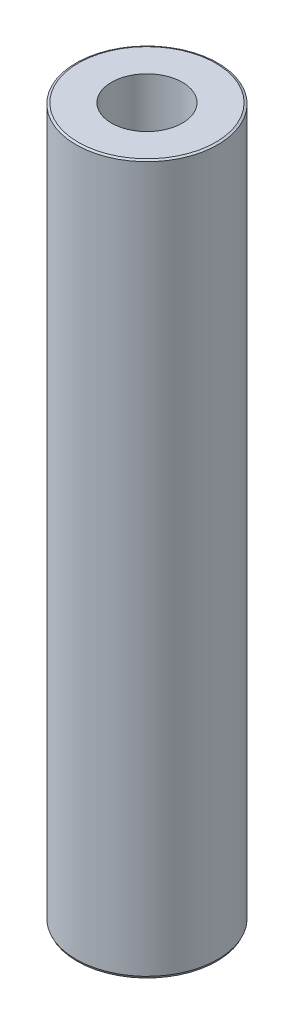
ISO-10303-21;
HEADER;
FILE_DESCRIPTION(('STEP AP214'),'2;1');
FILE_NAME('part.step','',(''),(''),'','','');
FILE_SCHEMA(('AUTOMOTIVE_DESIGN { 1 0 10303 214 1 1 1 1 }'));
ENDSEC;
DATA;
#1=APPLICATION_CONTEXT('core data for automotive mechanical design processes');
#2=APPLICATION_PROTOCOL_DEFINITION('international standard','automotive_design',2000,#1);
#3=PRODUCT_CONTEXT('',#1,'mechanical');
#4=PRODUCT('Part','Part','',(#3));
#5=PRODUCT_RELATED_PRODUCT_CATEGORY('part','',(#4));
#6=PRODUCT_DEFINITION_FORMATION('','',#4);
#7=PRODUCT_DEFINITION_CONTEXT('part definition',#1,'design');
#8=PRODUCT_DEFINITION('design','',#6,#7);
#9=PRODUCT_DEFINITION_SHAPE('','',#8);
#10=(LENGTH_UNIT() NAMED_UNIT(*) SI_UNIT(.MILLI.,.METRE.));
#11=(NAMED_UNIT(*) PLANE_ANGLE_UNIT() SI_UNIT($,.RADIAN.));
#12=(NAMED_UNIT(*) SI_UNIT($,.STERADIAN.) SOLID_ANGLE_UNIT());
#13=UNCERTAINTY_MEASURE_WITH_UNIT(LENGTH_MEASURE(1.E-05),#10,'distance_accuracy_value','');
#14=(GEOMETRIC_REPRESENTATION_CONTEXT(3) GLOBAL_UNCERTAINTY_ASSIGNED_CONTEXT((#13)) GLOBAL_UNIT_ASSIGNED_CONTEXT((#10,
#11,#12)) REPRESENTATION_CONTEXT('',''));
#15=CARTESIAN_POINT('',(0.,0.,0.));
#16=DIRECTION('',(0.,0.,1.));
#17=DIRECTION('',(1.,0.,0.));
#18=AXIS2_PLACEMENT_3D('',#15,#16,#17);
#19=CARTESIAN_POINT('',(0.,600.,0.));
#20=DIRECTION('',(0.,-1.,0.));
#21=DIRECTION('',(0.,0.,-1.));
#22=AXIS2_PLACEMENT_3D('',#19,#20,#21);
#23=CYLINDRICAL_SURFACE('',#22,60.);
#24=CARTESIAN_POINT('',(0.,599.149189009084,0.));
#25=DIRECTION('',(0.,1.,0.));
#26=DIRECTION('',(0.,0.,1.));
#27=AXIS2_PLACEMENT_3D('',#24,#25,#26);
#28=CIRCLE('',#27,60.);
#29=CARTESIAN_POINT('',(0.,599.149189009084,60.));
#30=VERTEX_POINT('',#29);
#31=EDGE_CURVE('E50',#30,#30,#28,.F.);
#32=ORIENTED_EDGE('',*,*,#31,.T.);
#33=EDGE_LOOP('',(#32));
#34=FACE_BOUND('',#33,.T.);
#35=CARTESIAN_POINT('',(0.,1.83664152043228,0.));
#36=DIRECTION('',(0.,1.,0.));
#37=DIRECTION('',(0.,0.,1.));
#38=AXIS2_PLACEMENT_3D('',#35,#36,#37);
#39=CIRCLE('',#38,60.);
#40=CARTESIAN_POINT('',(0.,1.83664152043228,60.));
#41=VERTEX_POINT('',#40);
#42=EDGE_CURVE('E51',#41,#41,#39,.T.);
#43=ORIENTED_EDGE('',*,*,#42,.T.);
#44=EDGE_LOOP('',(#43));
#45=FACE_BOUND('',#44,.T.);
#46=ADVANCED_FACE('F39',(#34,#45),#23,.T.);
#47=CARTESIAN_POINT('',(0.,600.,0.));
#48=DIRECTION('',(0.,1.,0.));
#49=DIRECTION('',(0.,0.,1.));
#50=AXIS2_PLACEMENT_3D('',#47,#48,#49);
#51=PLANE('',#50);
#52=CARTESIAN_POINT('',(0.,600.,0.));
#53=DIRECTION('',(0.,1.,0.));
#54=DIRECTION('',(0.,0.,1.));
#55=AXIS2_PLACEMENT_3D('',#52,#53,#54);
#56=CIRCLE('',#55,58.1633584795674);
#57=CARTESIAN_POINT('',(0.,600.,58.1633584795674));
#58=VERTEX_POINT('',#57);
#59=EDGE_CURVE('E54',#58,#58,#56,.T.);
#60=ORIENTED_EDGE('',*,*,#59,.T.);
#61=EDGE_LOOP('',(#60));
#62=FACE_BOUND('',#61,.T.);
#63=CARTESIAN_POINT('',(0.,600.,0.));
#64=DIRECTION('',(0.,1.,0.));
#65=DIRECTION('',(0.,0.,1.));
#66=AXIS2_PLACEMENT_3D('',#63,#64,#65);
#67=CIRCLE('',#66,29.9901134246437);
#68=CARTESIAN_POINT('',(0.,600.,29.9901134246437));
#69=VERTEX_POINT('',#68);
#70=EDGE_CURVE('E58',#69,#69,#67,.T.);
#71=ORIENTED_EDGE('',*,*,#70,.F.);
#72=EDGE_LOOP('',(#71));
#73=FACE_BOUND('',#72,.T.);
#74=ADVANCED_FACE('F69',(#62,#73),#51,.T.);
#75=CARTESIAN_POINT('',(0.,0.,0.));
#76=DIRECTION('',(0.,1.,0.));
#77=DIRECTION('',(0.,0.,1.));
#78=AXIS2_PLACEMENT_3D('',#75,#76,#77);
#79=PLANE('',#78);
#80=CARTESIAN_POINT('',(0.,0.,0.));
#81=DIRECTION('',(0.,1.,0.));
#82=DIRECTION('',(0.,0.,1.));
#83=AXIS2_PLACEMENT_3D('',#80,#81,#82);
#84=CIRCLE('',#83,59.149189009084);
#85=CARTESIAN_POINT('',(0.,0.,59.149189009084));
#86=VERTEX_POINT('',#85);
#87=EDGE_CURVE('E10',#86,#86,#84,.F.);
#88=ORIENTED_EDGE('',*,*,#87,.T.);
#89=EDGE_LOOP('',(#88));
#90=FACE_BOUND('',#89,.T.);
#91=CARTESIAN_POINT('',(0.,0.,0.));
#92=DIRECTION('',(0.,1.,0.));
#93=DIRECTION('',(0.,0.,1.));
#94=AXIS2_PLACEMENT_3D('',#91,#92,#93);
#95=CIRCLE('',#94,29.9901134246437);
#96=CARTESIAN_POINT('',(0.,0.,29.9901134246437));
#97=VERTEX_POINT('',#96);
#98=EDGE_CURVE('E63',#97,#97,#95,.T.);
#99=ORIENTED_EDGE('',*,*,#98,.T.);
#100=EDGE_LOOP('',(#99));
#101=FACE_BOUND('',#100,.T.);
#102=ADVANCED_FACE('F75',(#90,#101),#79,.F.);
#103=CARTESIAN_POINT('',(0.,600.,0.));
#104=DIRECTION('',(0.,-1.,0.));
#105=DIRECTION('',(0.,0.,-1.));
#106=AXIS2_PLACEMENT_3D('',#103,#104,#105);
#107=CYLINDRICAL_SURFACE('',#106,29.9901134246437);
#108=ORIENTED_EDGE('',*,*,#70,.T.);
#109=EDGE_LOOP('',(#108));
#110=FACE_BOUND('',#109,.T.);
#111=ORIENTED_EDGE('',*,*,#98,.F.);
#112=EDGE_LOOP('',(#111));
#113=FACE_BOUND('',#112,.T.);
#114=ADVANCED_FACE('F70',(#110,#113),#107,.F.);
#115=CARTESIAN_POINT('',(0.,600.,0.));
#116=DIRECTION('',(0.,-1.,0.));
#117=DIRECTION('',(0.,0.,-1.));
#118=AXIS2_PLACEMENT_3D('',#115,#116,#117);
#119=CONICAL_SURFACE('',#118,58.1633584795674,1.13698440907179);
#120=ORIENTED_EDGE('',*,*,#31,.F.);
#121=EDGE_LOOP('',(#120));
#122=FACE_BOUND('',#121,.T.);
#123=ORIENTED_EDGE('',*,*,#59,.F.);
#124=EDGE_LOOP('',(#123));
#125=FACE_BOUND('',#124,.T.);
#126=ADVANCED_FACE('F81',(#122,#125),#119,.T.);
#127=CARTESIAN_POINT('',(0.,1.83664152043228,0.));
#128=DIRECTION('',(0.,1.,0.));
#129=DIRECTION('',(0.,0.,1.));
#130=AXIS2_PLACEMENT_3D('',#127,#128,#129);
#131=CONICAL_SURFACE('',#130,60.,0.433811917723083);
#132=ORIENTED_EDGE('',*,*,#87,.F.);
#133=EDGE_LOOP('',(#132));
#134=FACE_BOUND('',#133,.T.);
#135=ORIENTED_EDGE('',*,*,#42,.F.);
#136=EDGE_LOOP('',(#135));
#137=FACE_BOUND('',#136,.T.);
#138=ADVANCED_FACE('F45',(#134,#137),#131,.T.);
#139=CLOSED_SHELL('',(#46,#74,#102,#114,#126,#138));
#140=MANIFOLD_SOLID_BREP('B2',#139);
#141=ADVANCED_BREP_SHAPE_REPRESENTATION('',(#18,#140),#14);
#142=SHAPE_DEFINITION_REPRESENTATION(#9,#141);
ENDSEC;
END-ISO-10303-21;
